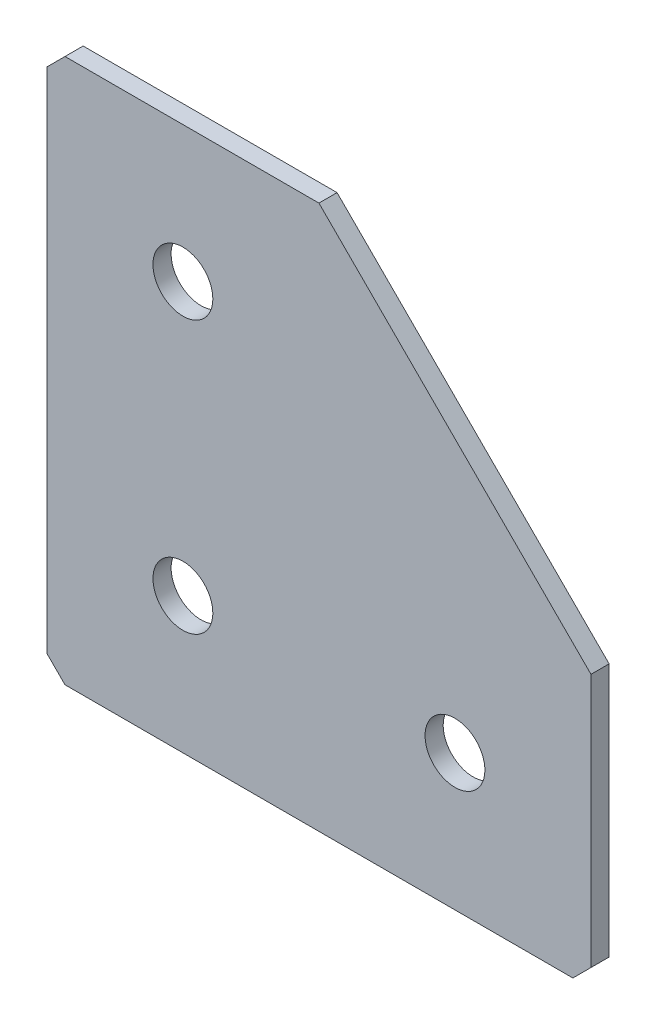
ISO-10303-21;
HEADER;
FILE_DESCRIPTION(('STEP AP214'),'2;1');
FILE_NAME('part.step','',(''),(''),'','','');
FILE_SCHEMA(('AUTOMOTIVE_DESIGN { 1 0 10303 214 1 1 1 1 }'));
ENDSEC;
DATA;
#1=APPLICATION_CONTEXT('core data for automotive mechanical design processes');
#2=APPLICATION_PROTOCOL_DEFINITION('international standard','automotive_design',2000,#1);
#3=PRODUCT_CONTEXT('',#1,'mechanical');
#4=PRODUCT('Part','Part','',(#3));
#5=PRODUCT_RELATED_PRODUCT_CATEGORY('part','',(#4));
#6=PRODUCT_DEFINITION_FORMATION('','',#4);
#7=PRODUCT_DEFINITION_CONTEXT('part definition',#1,'design');
#8=PRODUCT_DEFINITION('design','',#6,#7);
#9=PRODUCT_DEFINITION_SHAPE('','',#8);
#10=(LENGTH_UNIT() NAMED_UNIT(*) SI_UNIT(.MILLI.,.METRE.));
#11=(NAMED_UNIT(*) PLANE_ANGLE_UNIT() SI_UNIT($,.RADIAN.));
#12=(NAMED_UNIT(*) SI_UNIT($,.STERADIAN.) SOLID_ANGLE_UNIT());
#13=UNCERTAINTY_MEASURE_WITH_UNIT(LENGTH_MEASURE(1.E-05),#10,'distance_accuracy_value','');
#14=(GEOMETRIC_REPRESENTATION_CONTEXT(3) GLOBAL_UNCERTAINTY_ASSIGNED_CONTEXT((#13)) GLOBAL_UNIT_ASSIGNED_CONTEXT((#10,
#11,#12)) REPRESENTATION_CONTEXT('',''));
#15=CARTESIAN_POINT('',(0.,0.,0.));
#16=DIRECTION('',(0.,0.,1.));
#17=DIRECTION('',(1.,0.,0.));
#18=AXIS2_PLACEMENT_3D('',#15,#16,#17);
#19=CARTESIAN_POINT('',(30.,0.,-2.));
#20=DIRECTION('',(0.,-1.,0.));
#21=DIRECTION('',(1.,0.,0.));
#22=AXIS2_PLACEMENT_3D('',#19,#20,#21);
#23=PLANE('',#22);
#24=DIRECTION('',(1.,0.,0.));
#25=VECTOR('',#24,1.);
#26=CARTESIAN_POINT('',(30.,0.,-2.));
#27=LINE('',#26,#25);
#28=CARTESIAN_POINT('',(2.00000000000001,0.,-2.));
#29=VERTEX_POINT('',#28);
#30=CARTESIAN_POINT('',(30.,0.,-2.));
#31=VERTEX_POINT('',#30);
#32=EDGE_CURVE('E106',#29,#31,#27,.T.);
#33=ORIENTED_EDGE('',*,*,#32,.F.);
#34=DIRECTION('',(0.,0.,1.));
#35=VECTOR('',#34,1.);
#36=CARTESIAN_POINT('',(2.00000000000001,0.,-2.));
#37=LINE('',#36,#35);
#38=CARTESIAN_POINT('',(2.00000000000001,0.,0.));
#39=VERTEX_POINT('',#38);
#40=EDGE_CURVE('E135',#29,#39,#37,.T.);
#41=ORIENTED_EDGE('',*,*,#40,.T.);
#42=DIRECTION('',(1.,0.,0.));
#43=VECTOR('',#42,1.);
#44=CARTESIAN_POINT('',(30.,0.,0.));
#45=LINE('',#44,#43);
#46=CARTESIAN_POINT('',(30.,0.,0.));
#47=VERTEX_POINT('',#46);
#48=EDGE_CURVE('E132',#39,#47,#45,.T.);
#49=ORIENTED_EDGE('',*,*,#48,.T.);
#50=DIRECTION('',(0.,0.,1.));
#51=VECTOR('',#50,1.);
#52=CARTESIAN_POINT('',(30.,0.,-2.));
#53=LINE('',#52,#51);
#54=EDGE_CURVE('E124',#31,#47,#53,.T.);
#55=ORIENTED_EDGE('',*,*,#54,.F.);
#56=EDGE_LOOP('',(#33,#41,#49,#55));
#57=FACE_BOUND('',#56,.T.);
#58=ADVANCED_FACE('F41',(#57),#23,.F.);
#59=CARTESIAN_POINT('',(60.,-30.,-2.));
#60=DIRECTION('',(-0.707106781186547,-0.707106781186547,0.));
#61=DIRECTION('',(0.707106781186548,-0.707106781186548,0.));
#62=AXIS2_PLACEMENT_3D('',#59,#60,#61);
#63=PLANE('',#62);
#64=DIRECTION('',(0.707106781186547,-0.707106781186547,0.));
#65=VECTOR('',#64,1.);
#66=CARTESIAN_POINT('',(60.,-30.,0.));
#67=LINE('',#66,#65);
#68=CARTESIAN_POINT('',(60.,-30.,0.));
#69=VERTEX_POINT('',#68);
#70=EDGE_CURVE('E190',#47,#69,#67,.T.);
#71=ORIENTED_EDGE('',*,*,#70,.T.);
#72=DIRECTION('',(0.,0.,1.));
#73=VECTOR('',#72,1.);
#74=CARTESIAN_POINT('',(60.,-30.,-2.));
#75=LINE('',#74,#73);
#76=CARTESIAN_POINT('',(60.,-30.,-2.));
#77=VERTEX_POINT('',#76);
#78=EDGE_CURVE('E126',#77,#69,#75,.T.);
#79=ORIENTED_EDGE('',*,*,#78,.F.);
#80=DIRECTION('',(0.707106781186547,-0.707106781186547,0.));
#81=VECTOR('',#80,1.);
#82=CARTESIAN_POINT('',(60.,-30.,-2.));
#83=LINE('',#82,#81);
#84=EDGE_CURVE('E110',#31,#77,#83,.T.);
#85=ORIENTED_EDGE('',*,*,#84,.F.);
#86=ORIENTED_EDGE('',*,*,#54,.T.);
#87=EDGE_LOOP('',(#71,#79,#85,#86));
#88=FACE_BOUND('',#87,.T.);
#89=ADVANCED_FACE('F123',(#88),#63,.F.);
#90=CARTESIAN_POINT('',(60.,-60.,-2.));
#91=DIRECTION('',(-1.,0.,0.));
#92=DIRECTION('',(0.,-1.,0.));
#93=AXIS2_PLACEMENT_3D('',#90,#91,#92);
#94=PLANE('',#93);
#95=DIRECTION('',(0.,-1.,0.));
#96=VECTOR('',#95,1.);
#97=CARTESIAN_POINT('',(60.,-60.,0.));
#98=LINE('',#97,#96);
#99=CARTESIAN_POINT('',(60.,-58.,0.));
#100=VERTEX_POINT('',#99);
#101=EDGE_CURVE('E184',#69,#100,#98,.T.);
#102=ORIENTED_EDGE('',*,*,#101,.T.);
#103=DIRECTION('',(0.,0.,-1.));
#104=VECTOR('',#103,1.);
#105=CARTESIAN_POINT('',(60.,-58.,-2.));
#106=LINE('',#105,#104);
#107=CARTESIAN_POINT('',(60.,-58.,-2.));
#108=VERTEX_POINT('',#107);
#109=EDGE_CURVE('E11',#100,#108,#106,.T.);
#110=ORIENTED_EDGE('',*,*,#109,.T.);
#111=DIRECTION('',(0.,-1.,0.));
#112=VECTOR('',#111,1.);
#113=CARTESIAN_POINT('',(60.,-60.,-2.));
#114=LINE('',#113,#112);
#115=EDGE_CURVE('E129',#77,#108,#114,.T.);
#116=ORIENTED_EDGE('',*,*,#115,.F.);
#117=ORIENTED_EDGE('',*,*,#78,.T.);
#118=EDGE_LOOP('',(#102,#110,#116,#117));
#119=FACE_BOUND('',#118,.T.);
#120=ADVANCED_FACE('F258',(#119),#94,.F.);
#121=CARTESIAN_POINT('',(0.,-60.,-2.));
#122=DIRECTION('',(0.,1.,0.));
#123=DIRECTION('',(0.,0.,1.));
#124=AXIS2_PLACEMENT_3D('',#121,#122,#123);
#125=PLANE('',#124);
#126=DIRECTION('',(-1.,0.,0.));
#127=VECTOR('',#126,1.);
#128=CARTESIAN_POINT('',(0.,-60.,-2.));
#129=LINE('',#128,#127);
#130=CARTESIAN_POINT('',(58.,-60.,-2.));
#131=VERTEX_POINT('',#130);
#132=CARTESIAN_POINT('',(2.00000000000001,-60.,-2.));
#133=VERTEX_POINT('',#132);
#134=EDGE_CURVE('E176',#131,#133,#129,.T.);
#135=ORIENTED_EDGE('',*,*,#134,.F.);
#136=DIRECTION('',(0.,0.,1.));
#137=VECTOR('',#136,1.);
#138=CARTESIAN_POINT('',(58.,-60.,-2.));
#139=LINE('',#138,#137);
#140=CARTESIAN_POINT('',(58.,-60.,0.));
#141=VERTEX_POINT('',#140);
#142=EDGE_CURVE('E50',#131,#141,#139,.T.);
#143=ORIENTED_EDGE('',*,*,#142,.T.);
#144=DIRECTION('',(-1.,0.,0.));
#145=VECTOR('',#144,1.);
#146=CARTESIAN_POINT('',(0.,-60.,0.));
#147=LINE('',#146,#145);
#148=CARTESIAN_POINT('',(2.00000000000001,-60.,0.));
#149=VERTEX_POINT('',#148);
#150=EDGE_CURVE('E175',#141,#149,#147,.T.);
#151=ORIENTED_EDGE('',*,*,#150,.T.);
#152=DIRECTION('',(0.,0.,-1.));
#153=VECTOR('',#152,1.);
#154=CARTESIAN_POINT('',(2.00000000000002,-60.,-2.));
#155=LINE('',#154,#153);
#156=EDGE_CURVE('E57',#149,#133,#155,.T.);
#157=ORIENTED_EDGE('',*,*,#156,.T.);
#158=EDGE_LOOP('',(#135,#143,#151,#157));
#159=FACE_BOUND('',#158,.T.);
#160=ADVANCED_FACE('F174',(#159),#125,.F.);
#161=CARTESIAN_POINT('',(0.,0.,-2.));
#162=DIRECTION('',(1.,0.,0.));
#163=DIRECTION('',(0.,0.,-1.));
#164=AXIS2_PLACEMENT_3D('',#161,#162,#163);
#165=PLANE('',#164);
#166=DIRECTION('',(0.,1.,0.));
#167=VECTOR('',#166,1.);
#168=CARTESIAN_POINT('',(0.,0.,0.));
#169=LINE('',#168,#167);
#170=CARTESIAN_POINT('',(0.,-58.,0.));
#171=VERTEX_POINT('',#170);
#172=CARTESIAN_POINT('',(0.,-2.00000000000001,0.));
#173=VERTEX_POINT('',#172);
#174=EDGE_CURVE('E119',#171,#173,#169,.T.);
#175=ORIENTED_EDGE('',*,*,#174,.T.);
#176=DIRECTION('',(0.,0.,-1.));
#177=VECTOR('',#176,1.);
#178=CARTESIAN_POINT('',(0.,-2.00000000000002,-2.));
#179=LINE('',#178,#177);
#180=CARTESIAN_POINT('',(0.,-2.00000000000001,-2.));
#181=VERTEX_POINT('',#180);
#182=EDGE_CURVE('E158',#173,#181,#179,.T.);
#183=ORIENTED_EDGE('',*,*,#182,.T.);
#184=DIRECTION('',(0.,1.,0.));
#185=VECTOR('',#184,1.);
#186=CARTESIAN_POINT('',(0.,0.,-2.));
#187=LINE('',#186,#185);
#188=CARTESIAN_POINT('',(0.,-58.,-2.));
#189=VERTEX_POINT('',#188);
#190=EDGE_CURVE('E142',#189,#181,#187,.T.);
#191=ORIENTED_EDGE('',*,*,#190,.F.);
#192=DIRECTION('',(0.,0.,1.));
#193=VECTOR('',#192,1.);
#194=CARTESIAN_POINT('',(0.,-58.,-2.));
#195=LINE('',#194,#193);
#196=EDGE_CURVE('E154',#189,#171,#195,.T.);
#197=ORIENTED_EDGE('',*,*,#196,.T.);
#198=EDGE_LOOP('',(#175,#183,#191,#197));
#199=FACE_BOUND('',#198,.T.);
#200=ADVANCED_FACE('F233',(#199),#165,.F.);
#201=CARTESIAN_POINT('',(0.,0.,-2.));
#202=DIRECTION('',(0.,0.,1.));
#203=DIRECTION('',(1.,0.,0.));
#204=AXIS2_PLACEMENT_3D('',#201,#202,#203);
#205=PLANE('',#204);
#206=CARTESIAN_POINT('',(15.,-45.,-2.));
#207=DIRECTION('',(0.,0.,-1.));
#208=DIRECTION('',(0.,1.,0.));
#209=AXIS2_PLACEMENT_3D('',#206,#207,#208);
#210=CIRCLE('',#209,3.3);
#211=CARTESIAN_POINT('',(15.,-41.7,-2.));
#212=VERTEX_POINT('',#211);
#213=EDGE_CURVE('E223',#212,#212,#210,.T.);
#214=ORIENTED_EDGE('',*,*,#213,.F.);
#215=EDGE_LOOP('',(#214));
#216=FACE_BOUND('',#215,.T.);
#217=CARTESIAN_POINT('',(15.,-15.,-2.));
#218=DIRECTION('',(0.,0.,-1.));
#219=DIRECTION('',(0.,1.,0.));
#220=AXIS2_PLACEMENT_3D('',#217,#218,#219);
#221=CIRCLE('',#220,3.3);
#222=CARTESIAN_POINT('',(15.,-11.7,-2.));
#223=VERTEX_POINT('',#222);
#224=EDGE_CURVE('E215',#223,#223,#221,.T.);
#225=ORIENTED_EDGE('',*,*,#224,.F.);
#226=EDGE_LOOP('',(#225));
#227=FACE_BOUND('',#226,.T.);
#228=CARTESIAN_POINT('',(45.,-45.,-2.));
#229=DIRECTION('',(0.,0.,-1.));
#230=DIRECTION('',(0.,1.,0.));
#231=AXIS2_PLACEMENT_3D('',#228,#229,#230);
#232=CIRCLE('',#231,3.3);
#233=CARTESIAN_POINT('',(45.,-41.7,-2.));
#234=VERTEX_POINT('',#233);
#235=EDGE_CURVE('E207',#234,#234,#232,.T.);
#236=ORIENTED_EDGE('',*,*,#235,.F.);
#237=EDGE_LOOP('',(#236));
#238=FACE_BOUND('',#237,.T.);
#239=ORIENTED_EDGE('',*,*,#190,.T.);
#240=DIRECTION('',(-0.707106781186546,-0.707106781186549,0.));
#241=VECTOR('',#240,1.);
#242=CARTESIAN_POINT('',(2.00000000000001,0.,-2.));
#243=LINE('',#242,#241);
#244=EDGE_CURVE('E113',#181,#29,#243,.F.);
#245=ORIENTED_EDGE('',*,*,#244,.T.);
#246=ORIENTED_EDGE('',*,*,#32,.T.);
#247=ORIENTED_EDGE('',*,*,#84,.T.);
#248=ORIENTED_EDGE('',*,*,#115,.T.);
#249=DIRECTION('',(0.707106781186546,0.707106781186549,0.));
#250=VECTOR('',#249,1.);
#251=CARTESIAN_POINT('',(58.,-60.,-2.));
#252=LINE('',#251,#250);
#253=EDGE_CURVE('E64',#108,#131,#252,.F.);
#254=ORIENTED_EDGE('',*,*,#253,.T.);
#255=ORIENTED_EDGE('',*,*,#134,.T.);
#256=DIRECTION('',(0.707106781186549,-0.707106781186546,0.));
#257=VECTOR('',#256,1.);
#258=CARTESIAN_POINT('',(0.,-58.,-2.));
#259=LINE('',#258,#257);
#260=EDGE_CURVE('E161',#133,#189,#259,.F.);
#261=ORIENTED_EDGE('',*,*,#260,.T.);
#262=EDGE_LOOP('',(#239,#245,#246,#247,#248,#254,#255,#261));
#263=FACE_BOUND('',#262,.T.);
#264=ADVANCED_FACE('F109',(#216,#227,#238,#263),#205,.F.);
#265=CARTESIAN_POINT('',(0.,0.,0.));
#266=DIRECTION('',(0.,0.,1.));
#267=DIRECTION('',(1.,0.,0.));
#268=AXIS2_PLACEMENT_3D('',#265,#266,#267);
#269=PLANE('',#268);
#270=CARTESIAN_POINT('',(15.,-45.,0.));
#271=DIRECTION('',(0.,0.,-1.));
#272=DIRECTION('',(0.,1.,0.));
#273=AXIS2_PLACEMENT_3D('',#270,#271,#272);
#274=CIRCLE('',#273,3.3);
#275=CARTESIAN_POINT('',(15.,-41.7,0.));
#276=VERTEX_POINT('',#275);
#277=EDGE_CURVE('E219',#276,#276,#274,.T.);
#278=ORIENTED_EDGE('',*,*,#277,.T.);
#279=EDGE_LOOP('',(#278));
#280=FACE_BOUND('',#279,.T.);
#281=CARTESIAN_POINT('',(15.,-15.,0.));
#282=DIRECTION('',(0.,0.,-1.));
#283=DIRECTION('',(0.,1.,0.));
#284=AXIS2_PLACEMENT_3D('',#281,#282,#283);
#285=CIRCLE('',#284,3.3);
#286=CARTESIAN_POINT('',(15.,-11.7,0.));
#287=VERTEX_POINT('',#286);
#288=EDGE_CURVE('E211',#287,#287,#285,.T.);
#289=ORIENTED_EDGE('',*,*,#288,.T.);
#290=EDGE_LOOP('',(#289));
#291=FACE_BOUND('',#290,.T.);
#292=CARTESIAN_POINT('',(45.,-45.,0.));
#293=DIRECTION('',(0.,0.,-1.));
#294=DIRECTION('',(0.,1.,0.));
#295=AXIS2_PLACEMENT_3D('',#292,#293,#294);
#296=CIRCLE('',#295,3.3);
#297=CARTESIAN_POINT('',(45.,-41.7,0.));
#298=VERTEX_POINT('',#297);
#299=EDGE_CURVE('E197',#298,#298,#296,.T.);
#300=ORIENTED_EDGE('',*,*,#299,.T.);
#301=EDGE_LOOP('',(#300));
#302=FACE_BOUND('',#301,.T.);
#303=ORIENTED_EDGE('',*,*,#48,.F.);
#304=DIRECTION('',(0.707106781186546,0.707106781186549,0.));
#305=VECTOR('',#304,1.);
#306=CARTESIAN_POINT('',(1.00000000000001,-1.,0.));
#307=LINE('',#306,#305);
#308=EDGE_CURVE('E151',#39,#173,#307,.F.);
#309=ORIENTED_EDGE('',*,*,#308,.T.);
#310=ORIENTED_EDGE('',*,*,#174,.F.);
#311=DIRECTION('',(-0.707106781186549,0.707106781186546,0.));
#312=VECTOR('',#311,1.);
#313=CARTESIAN_POINT('',(-29.,-29.0000000000001,0.));
#314=LINE('',#313,#312);
#315=EDGE_CURVE('E140',#171,#149,#314,.F.);
#316=ORIENTED_EDGE('',*,*,#315,.T.);
#317=ORIENTED_EDGE('',*,*,#150,.F.);
#318=DIRECTION('',(-0.707106781186546,-0.707106781186549,0.));
#319=VECTOR('',#318,1.);
#320=CARTESIAN_POINT('',(59.0000000000001,-58.9999999999999,0.));
#321=LINE('',#320,#319);
#322=EDGE_CURVE('E148',#141,#100,#321,.F.);
#323=ORIENTED_EDGE('',*,*,#322,.T.);
#324=ORIENTED_EDGE('',*,*,#101,.F.);
#325=ORIENTED_EDGE('',*,*,#70,.F.);
#326=EDGE_LOOP('',(#303,#309,#310,#316,#317,#323,#324,#325));
#327=FACE_BOUND('',#326,.T.);
#328=ADVANCED_FACE('F179',(#280,#291,#302,#327),#269,.T.);
#329=CARTESIAN_POINT('',(45.,-45.,-2.));
#330=DIRECTION('',(0.,0.,-1.));
#331=DIRECTION('',(0.,1.,0.));
#332=AXIS2_PLACEMENT_3D('',#329,#330,#331);
#333=CYLINDRICAL_SURFACE('',#332,3.3);
#334=ORIENTED_EDGE('',*,*,#299,.F.);
#335=EDGE_LOOP('',(#334));
#336=FACE_BOUND('',#335,.T.);
#337=ORIENTED_EDGE('',*,*,#235,.T.);
#338=EDGE_LOOP('',(#337));
#339=FACE_BOUND('',#338,.T.);
#340=ADVANCED_FACE('F239',(#336,#339),#333,.F.);
#341=CARTESIAN_POINT('',(15.,-15.,-2.));
#342=DIRECTION('',(0.,0.,-1.));
#343=DIRECTION('',(0.,1.,0.));
#344=AXIS2_PLACEMENT_3D('',#341,#342,#343);
#345=CYLINDRICAL_SURFACE('',#344,3.3);
#346=ORIENTED_EDGE('',*,*,#288,.F.);
#347=EDGE_LOOP('',(#346));
#348=FACE_BOUND('',#347,.T.);
#349=ORIENTED_EDGE('',*,*,#224,.T.);
#350=EDGE_LOOP('',(#349));
#351=FACE_BOUND('',#350,.T.);
#352=ADVANCED_FACE('F241',(#348,#351),#345,.F.);
#353=CARTESIAN_POINT('',(15.,-45.,-2.));
#354=DIRECTION('',(0.,0.,-1.));
#355=DIRECTION('',(0.,1.,0.));
#356=AXIS2_PLACEMENT_3D('',#353,#354,#355);
#357=CYLINDRICAL_SURFACE('',#356,3.3);
#358=ORIENTED_EDGE('',*,*,#277,.F.);
#359=EDGE_LOOP('',(#358));
#360=FACE_BOUND('',#359,.T.);
#361=ORIENTED_EDGE('',*,*,#213,.T.);
#362=EDGE_LOOP('',(#361));
#363=FACE_BOUND('',#362,.T.);
#364=ADVANCED_FACE('F229',(#360,#363),#357,.F.);
#365=CARTESIAN_POINT('',(2.00000000000001,0.,-2.));
#366=DIRECTION('',(0.707106781186549,-0.707106781186546,0.));
#367=DIRECTION('',(0.,0.,1.));
#368=AXIS2_PLACEMENT_3D('',#365,#366,#367);
#369=PLANE('',#368);
#370=ORIENTED_EDGE('',*,*,#244,.F.);
#371=ORIENTED_EDGE('',*,*,#182,.F.);
#372=ORIENTED_EDGE('',*,*,#308,.F.);
#373=ORIENTED_EDGE('',*,*,#40,.F.);
#374=EDGE_LOOP('',(#370,#371,#372,#373));
#375=FACE_BOUND('',#374,.T.);
#376=ADVANCED_FACE('F262',(#375),#369,.F.);
#377=CARTESIAN_POINT('',(58.,-60.,-2.));
#378=DIRECTION('',(-0.707106781186549,0.707106781186546,0.));
#379=DIRECTION('',(0.,0.,1.));
#380=AXIS2_PLACEMENT_3D('',#377,#378,#379);
#381=PLANE('',#380);
#382=ORIENTED_EDGE('',*,*,#253,.F.);
#383=ORIENTED_EDGE('',*,*,#109,.F.);
#384=ORIENTED_EDGE('',*,*,#322,.F.);
#385=ORIENTED_EDGE('',*,*,#142,.F.);
#386=EDGE_LOOP('',(#382,#383,#384,#385));
#387=FACE_BOUND('',#386,.T.);
#388=ADVANCED_FACE('F264',(#387),#381,.F.);
#389=CARTESIAN_POINT('',(0.,-58.,-2.));
#390=DIRECTION('',(0.707106781186546,0.707106781186549,0.));
#391=DIRECTION('',(0.,0.,1.));
#392=AXIS2_PLACEMENT_3D('',#389,#390,#391);
#393=PLANE('',#392);
#394=ORIENTED_EDGE('',*,*,#260,.F.);
#395=ORIENTED_EDGE('',*,*,#156,.F.);
#396=ORIENTED_EDGE('',*,*,#315,.F.);
#397=ORIENTED_EDGE('',*,*,#196,.F.);
#398=EDGE_LOOP('',(#394,#395,#396,#397));
#399=FACE_BOUND('',#398,.T.);
#400=ADVANCED_FACE('F43',(#399),#393,.F.);
#401=CLOSED_SHELL('',(#58,#89,#120,#160,#200,#264,#328,#340,#352,#364,#376,#388,#400));
#402=MANIFOLD_SOLID_BREP('B2',#401);
#403=ADVANCED_BREP_SHAPE_REPRESENTATION('',(#18,#402),#14);
#404=SHAPE_DEFINITION_REPRESENTATION(#9,#403);
ENDSEC;
END-ISO-10303-21;
